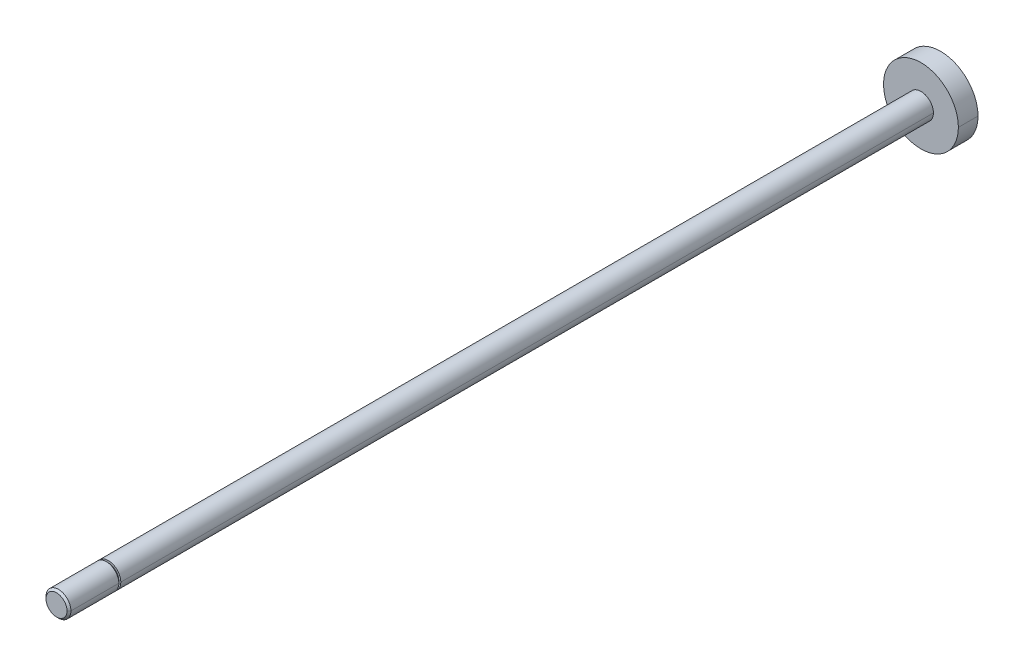
ISO-10303-21;
HEADER;
FILE_DESCRIPTION(('STEP AP214'),'2;1');
FILE_NAME('part.step','',(''),(''),'','','');
FILE_SCHEMA(('AUTOMOTIVE_DESIGN { 1 0 10303 214 1 1 1 1 }'));
ENDSEC;
DATA;
#1=APPLICATION_CONTEXT('core data for automotive mechanical design processes');
#2=APPLICATION_PROTOCOL_DEFINITION('international standard','automotive_design',2000,#1);
#3=PRODUCT_CONTEXT('',#1,'mechanical');
#4=PRODUCT('Part','Part','',(#3));
#5=PRODUCT_RELATED_PRODUCT_CATEGORY('part','',(#4));
#6=PRODUCT_DEFINITION_FORMATION('','',#4);
#7=PRODUCT_DEFINITION_CONTEXT('part definition',#1,'design');
#8=PRODUCT_DEFINITION('design','',#6,#7);
#9=PRODUCT_DEFINITION_SHAPE('','',#8);
#10=(LENGTH_UNIT() NAMED_UNIT(*) SI_UNIT(.MILLI.,.METRE.));
#11=(NAMED_UNIT(*) PLANE_ANGLE_UNIT() SI_UNIT($,.RADIAN.));
#12=(NAMED_UNIT(*) SI_UNIT($,.STERADIAN.) SOLID_ANGLE_UNIT());
#13=UNCERTAINTY_MEASURE_WITH_UNIT(LENGTH_MEASURE(1.E-05),#10,'distance_accuracy_value','');
#14=(GEOMETRIC_REPRESENTATION_CONTEXT(3) GLOBAL_UNCERTAINTY_ASSIGNED_CONTEXT((#13)) GLOBAL_UNIT_ASSIGNED_CONTEXT((#10,
#11,#12)) REPRESENTATION_CONTEXT('',''));
#15=CARTESIAN_POINT('',(0.,0.,0.));
#16=DIRECTION('',(0.,0.,1.));
#17=DIRECTION('',(1.,0.,0.));
#18=AXIS2_PLACEMENT_3D('',#15,#16,#17);
#19=CARTESIAN_POINT('',(0.,0.,146.431));
#20=DIRECTION('',(0.,0.,-1.));
#21=DIRECTION('',(0.,1.,0.));
#22=AXIS2_PLACEMENT_3D('',#19,#20,#21);
#23=PLANE('',#22);
#24=CARTESIAN_POINT('',(0.,0.,146.431));
#25=DIRECTION('',(0.,0.,-1.));
#26=DIRECTION('',(1.,0.,0.));
#27=AXIS2_PLACEMENT_3D('',#24,#25,#26);
#28=CIRCLE('',#27,2.67499999999996);
#29=CARTESIAN_POINT('',(2.67499999999996,0.,146.431));
#30=VERTEX_POINT('',#29);
#31=CARTESIAN_POINT('',(-2.67499999999996,0.,146.431));
#32=VERTEX_POINT('',#31);
#33=EDGE_CURVE('E135',#30,#32,#28,.T.);
#34=ORIENTED_EDGE('',*,*,#33,.F.);
#35=CARTESIAN_POINT('',(0.,0.,146.431));
#36=DIRECTION('',(0.,0.,-1.));
#37=DIRECTION('',(1.,0.,0.));
#38=AXIS2_PLACEMENT_3D('',#35,#36,#37);
#39=CIRCLE('',#38,2.67499999999996);
#40=EDGE_CURVE('E10',#32,#30,#39,.T.);
#41=ORIENTED_EDGE('',*,*,#40,.F.);
#42=EDGE_LOOP('',(#34,#41));
#43=FACE_BOUND('',#42,.T.);
#44=ADVANCED_FACE('F16',(#43),#23,.F.);
#45=CARTESIAN_POINT('',(0.,0.,146.431));
#46=DIRECTION('',(0.,0.,-1.));
#47=DIRECTION('',(1.,0.,0.));
#48=AXIS2_PLACEMENT_3D('',#45,#46,#47);
#49=CONICAL_SURFACE('',#48,2.67499999999996,0.785398163397452);
#50=DIRECTION('',(-0.70710678118655,0.,-0.707106781186545));
#51=VECTOR('',#50,1.);
#52=CARTESIAN_POINT('',(-2.67499999999996,0.,146.431));
#53=LINE('',#52,#51);
#54=CARTESIAN_POINT('',(-3.17499999999996,0.,145.931));
#55=VERTEX_POINT('',#54);
#56=EDGE_CURVE('E129',#32,#55,#53,.T.);
#57=ORIENTED_EDGE('',*,*,#56,.F.);
#58=ORIENTED_EDGE('',*,*,#40,.T.);
#59=DIRECTION('',(0.70710678118655,0.,-0.707106781186545));
#60=VECTOR('',#59,1.);
#61=CARTESIAN_POINT('',(2.67499999999996,0.,146.431));
#62=LINE('',#61,#60);
#63=CARTESIAN_POINT('',(3.17499999999996,0.,145.931));
#64=VERTEX_POINT('',#63);
#65=EDGE_CURVE('E126',#30,#64,#62,.T.);
#66=ORIENTED_EDGE('',*,*,#65,.T.);
#67=CARTESIAN_POINT('',(0.,0.,145.931));
#68=DIRECTION('',(0.,0.,-1.));
#69=DIRECTION('',(1.,0.,0.));
#70=AXIS2_PLACEMENT_3D('',#67,#68,#69);
#71=CIRCLE('',#70,3.17499999999996);
#72=EDGE_CURVE('E26',#55,#64,#71,.T.);
#73=ORIENTED_EDGE('',*,*,#72,.F.);
#74=EDGE_LOOP('',(#57,#58,#66,#73));
#75=FACE_BOUND('',#74,.T.);
#76=ADVANCED_FACE('F125',(#75),#49,.T.);
#77=CARTESIAN_POINT('',(0.,0.,155.411256121069));
#78=DIRECTION('',(0.,0.,-1.));
#79=DIRECTION('',(1.,0.,0.));
#80=AXIS2_PLACEMENT_3D('',#77,#78,#79);
#81=CYLINDRICAL_SURFACE('',#80,3.175);
#82=DIRECTION('',(0.,0.,-1.));
#83=VECTOR('',#82,1.);
#84=CARTESIAN_POINT('',(-3.175,0.,155.411256121069));
#85=LINE('',#84,#83);
#86=CARTESIAN_POINT('',(-3.17499999999996,0.,133.731));
#87=VERTEX_POINT('',#86);
#88=EDGE_CURVE('E139',#55,#87,#85,.T.);
#89=ORIENTED_EDGE('',*,*,#88,.F.);
#90=ORIENTED_EDGE('',*,*,#72,.T.);
#91=DIRECTION('',(0.,0.,-1.));
#92=VECTOR('',#91,1.);
#93=CARTESIAN_POINT('',(3.175,0.,155.411256121069));
#94=LINE('',#93,#92);
#95=CARTESIAN_POINT('',(3.17499999999996,0.,133.731));
#96=VERTEX_POINT('',#95);
#97=EDGE_CURVE('E182',#64,#96,#94,.T.);
#98=ORIENTED_EDGE('',*,*,#97,.T.);
#99=CARTESIAN_POINT('',(0.,0.,133.731));
#100=DIRECTION('',(0.,0.,-1.));
#101=DIRECTION('',(1.,0.,0.));
#102=AXIS2_PLACEMENT_3D('',#99,#100,#101);
#103=CIRCLE('',#102,3.17499999999996);
#104=EDGE_CURVE('E174',#87,#96,#103,.T.);
#105=ORIENTED_EDGE('',*,*,#104,.F.);
#106=EDGE_LOOP('',(#89,#90,#98,#105));
#107=FACE_BOUND('',#106,.T.);
#108=ADVANCED_FACE('F257',(#107),#81,.T.);
#109=CARTESIAN_POINT('',(0.,0.,-76.2));
#110=DIRECTION('',(0.,0.,-1.));
#111=DIRECTION('',(1.,0.,0.));
#112=AXIS2_PLACEMENT_3D('',#109,#110,#111);
#113=CYLINDRICAL_SURFACE('',#112,2.67499999999996);
#114=DIRECTION('',(0.,0.,-1.));
#115=VECTOR('',#114,1.);
#116=CARTESIAN_POINT('',(-2.67499999999996,0.,-76.2));
#117=LINE('',#116,#115);
#118=CARTESIAN_POINT('',(-2.67499999999996,0.,133.731));
#119=VERTEX_POINT('',#118);
#120=CARTESIAN_POINT('',(-2.67499999999996,0.,133.231));
#121=VERTEX_POINT('',#120);
#122=EDGE_CURVE('E151',#119,#121,#117,.T.);
#123=ORIENTED_EDGE('',*,*,#122,.F.);
#124=CARTESIAN_POINT('',(0.,0.,133.731));
#125=DIRECTION('',(0.,0.,-1.));
#126=DIRECTION('',(1.,0.,0.));
#127=AXIS2_PLACEMENT_3D('',#124,#125,#126);
#128=CIRCLE('',#127,2.67499999999996);
#129=CARTESIAN_POINT('',(2.67499999999996,0.,133.731));
#130=VERTEX_POINT('',#129);
#131=EDGE_CURVE('E108',#119,#130,#128,.T.);
#132=ORIENTED_EDGE('',*,*,#131,.T.);
#133=DIRECTION('',(0.,0.,-1.));
#134=VECTOR('',#133,1.);
#135=CARTESIAN_POINT('',(2.67499999999996,0.,-76.2));
#136=LINE('',#135,#134);
#137=CARTESIAN_POINT('',(2.67499999999996,0.,133.231));
#138=VERTEX_POINT('',#137);
#139=EDGE_CURVE('E161',#130,#138,#136,.T.);
#140=ORIENTED_EDGE('',*,*,#139,.T.);
#141=CARTESIAN_POINT('',(0.,0.,133.231));
#142=DIRECTION('',(0.,0.,-1.));
#143=DIRECTION('',(1.,0.,0.));
#144=AXIS2_PLACEMENT_3D('',#141,#142,#143);
#145=CIRCLE('',#144,2.67499999999996);
#146=EDGE_CURVE('E171',#121,#138,#145,.T.);
#147=ORIENTED_EDGE('',*,*,#146,.F.);
#148=EDGE_LOOP('',(#123,#132,#140,#147));
#149=FACE_BOUND('',#148,.T.);
#150=ADVANCED_FACE('F262',(#149),#113,.T.);
#151=CARTESIAN_POINT('',(0.,-3.17499999999996,133.731));
#152=DIRECTION('',(0.,0.,1.));
#153=DIRECTION('',(-1.,0.,0.));
#154=AXIS2_PLACEMENT_3D('',#151,#152,#153);
#155=PLANE('',#154);
#156=CARTESIAN_POINT('',(0.,0.,133.731));
#157=DIRECTION('',(0.,0.,-1.));
#158=DIRECTION('',(1.,0.,0.));
#159=AXIS2_PLACEMENT_3D('',#156,#157,#158);
#160=CIRCLE('',#159,2.67499999999996);
#161=EDGE_CURVE('E179',#130,#119,#160,.T.);
#162=ORIENTED_EDGE('',*,*,#161,.F.);
#163=ORIENTED_EDGE('',*,*,#131,.F.);
#164=EDGE_LOOP('',(#162,#163));
#165=FACE_BOUND('',#164,.T.);
#166=CARTESIAN_POINT('',(0.,0.,133.731));
#167=DIRECTION('',(0.,0.,-1.));
#168=DIRECTION('',(1.,0.,0.));
#169=AXIS2_PLACEMENT_3D('',#166,#167,#168);
#170=CIRCLE('',#169,3.17499999999996);
#171=EDGE_CURVE('E206',#96,#87,#170,.T.);
#172=ORIENTED_EDGE('',*,*,#171,.T.);
#173=ORIENTED_EDGE('',*,*,#104,.T.);
#174=EDGE_LOOP('',(#172,#173));
#175=FACE_BOUND('',#174,.T.);
#176=ADVANCED_FACE('F264',(#165,#175),#155,.F.);
#177=CARTESIAN_POINT('',(0.,-2.67499999999996,133.231));
#178=DIRECTION('',(0.,0.,-1.));
#179=DIRECTION('',(0.,1.,0.));
#180=AXIS2_PLACEMENT_3D('',#177,#178,#179);
#181=PLANE('',#180);
#182=CARTESIAN_POINT('',(0.,0.,133.231));
#183=DIRECTION('',(0.,0.,-1.));
#184=DIRECTION('',(1.,0.,0.));
#185=AXIS2_PLACEMENT_3D('',#182,#183,#184);
#186=CIRCLE('',#185,2.67499999999996);
#187=EDGE_CURVE('E20',#138,#121,#186,.T.);
#188=ORIENTED_EDGE('',*,*,#187,.T.);
#189=ORIENTED_EDGE('',*,*,#146,.T.);
#190=EDGE_LOOP('',(#188,#189));
#191=FACE_BOUND('',#190,.T.);
#192=CARTESIAN_POINT('',(0.,0.,133.231));
#193=DIRECTION('',(0.,0.,-1.));
#194=DIRECTION('',(1.,0.,0.));
#195=AXIS2_PLACEMENT_3D('',#192,#193,#194);
#196=CIRCLE('',#195,3.175);
#197=CARTESIAN_POINT('',(3.175,0.,133.231));
#198=VERTEX_POINT('',#197);
#199=CARTESIAN_POINT('',(-3.175,0.,133.231));
#200=VERTEX_POINT('',#199);
#201=EDGE_CURVE('E156',#198,#200,#196,.T.);
#202=ORIENTED_EDGE('',*,*,#201,.F.);
#203=CARTESIAN_POINT('',(0.,0.,133.231));
#204=DIRECTION('',(0.,0.,-1.));
#205=DIRECTION('',(1.,0.,0.));
#206=AXIS2_PLACEMENT_3D('',#203,#204,#205);
#207=CIRCLE('',#206,3.175);
#208=EDGE_CURVE('E153',#200,#198,#207,.T.);
#209=ORIENTED_EDGE('',*,*,#208,.F.);
#210=EDGE_LOOP('',(#202,#209));
#211=FACE_BOUND('',#210,.T.);
#212=ADVANCED_FACE('F18',(#191,#211),#181,.F.);
#213=CARTESIAN_POINT('',(0.,0.,155.411256121069));
#214=DIRECTION('',(0.,0.,-1.));
#215=DIRECTION('',(1.,0.,0.));
#216=AXIS2_PLACEMENT_3D('',#213,#214,#215);
#217=CYLINDRICAL_SURFACE('',#216,3.175);
#218=DIRECTION('',(0.,0.,-1.));
#219=VECTOR('',#218,1.);
#220=CARTESIAN_POINT('',(-3.175,0.,155.411256121069));
#221=LINE('',#220,#219);
#222=CARTESIAN_POINT('',(-3.175,0.,-73.7));
#223=VERTEX_POINT('',#222);
#224=EDGE_CURVE('E160',#200,#223,#221,.T.);
#225=ORIENTED_EDGE('',*,*,#224,.F.);
#226=ORIENTED_EDGE('',*,*,#208,.T.);
#227=DIRECTION('',(0.,0.,-1.));
#228=VECTOR('',#227,1.);
#229=CARTESIAN_POINT('',(3.175,0.,155.411256121069));
#230=LINE('',#229,#228);
#231=CARTESIAN_POINT('',(3.175,0.,-73.7));
#232=VERTEX_POINT('',#231);
#233=EDGE_CURVE('E166',#198,#232,#230,.T.);
#234=ORIENTED_EDGE('',*,*,#233,.T.);
#235=CARTESIAN_POINT('',(0.,0.,-73.7));
#236=DIRECTION('',(0.,0.,1.));
#237=DIRECTION('',(-1.,0.,0.));
#238=AXIS2_PLACEMENT_3D('',#235,#236,#237);
#239=CIRCLE('',#238,3.175);
#240=EDGE_CURVE('E154',#232,#223,#239,.T.);
#241=ORIENTED_EDGE('',*,*,#240,.T.);
#242=EDGE_LOOP('',(#225,#226,#234,#241));
#243=FACE_BOUND('',#242,.T.);
#244=ADVANCED_FACE('F292',(#243),#217,.T.);
#245=CARTESIAN_POINT('',(0.,0.,-78.7));
#246=DIRECTION('',(0.,0.,1.));
#247=DIRECTION('',(-1.,0.,0.));
#248=AXIS2_PLACEMENT_3D('',#245,#246,#247);
#249=PLANE('',#248);
#250=CARTESIAN_POINT('',(0.,0.,-78.7));
#251=DIRECTION('',(0.,0.,1.));
#252=DIRECTION('',(-1.,0.,0.));
#253=AXIS2_PLACEMENT_3D('',#250,#251,#252);
#254=CIRCLE('',#253,9.525);
#255=CARTESIAN_POINT('',(9.525,0.,-78.7));
#256=VERTEX_POINT('',#255);
#257=CARTESIAN_POINT('',(-9.525,0.,-78.7));
#258=VERTEX_POINT('',#257);
#259=EDGE_CURVE('E39',#256,#258,#254,.T.);
#260=ORIENTED_EDGE('',*,*,#259,.F.);
#261=CARTESIAN_POINT('',(0.,0.,-78.7));
#262=DIRECTION('',(0.,0.,1.));
#263=DIRECTION('',(-1.,0.,0.));
#264=AXIS2_PLACEMENT_3D('',#261,#262,#263);
#265=CIRCLE('',#264,9.525);
#266=EDGE_CURVE('E200',#258,#256,#265,.T.);
#267=ORIENTED_EDGE('',*,*,#266,.F.);
#268=EDGE_LOOP('',(#260,#267));
#269=FACE_BOUND('',#268,.T.);
#270=ADVANCED_FACE('F249',(#269),#249,.F.);
#271=CARTESIAN_POINT('',(0.,0.,-73.7));
#272=DIRECTION('',(0.,0.,-1.));
#273=DIRECTION('',(1.,0.,0.));
#274=AXIS2_PLACEMENT_3D('',#271,#272,#273);
#275=CYLINDRICAL_SURFACE('',#274,9.525);
#276=DIRECTION('',(0.,0.,-1.));
#277=VECTOR('',#276,1.);
#278=CARTESIAN_POINT('',(-9.525,0.,-73.7));
#279=LINE('',#278,#277);
#280=CARTESIAN_POINT('',(-9.525,0.,-73.7));
#281=VERTEX_POINT('',#280);
#282=EDGE_CURVE('E213',#281,#258,#279,.T.);
#283=ORIENTED_EDGE('',*,*,#282,.F.);
#284=CARTESIAN_POINT('',(0.,0.,-73.7));
#285=DIRECTION('',(0.,0.,1.));
#286=DIRECTION('',(-1.,0.,0.));
#287=AXIS2_PLACEMENT_3D('',#284,#285,#286);
#288=CIRCLE('',#287,9.525);
#289=CARTESIAN_POINT('',(9.525,0.,-73.7));
#290=VERTEX_POINT('',#289);
#291=EDGE_CURVE('E185',#290,#281,#288,.T.);
#292=ORIENTED_EDGE('',*,*,#291,.F.);
#293=DIRECTION('',(0.,0.,-1.));
#294=VECTOR('',#293,1.);
#295=CARTESIAN_POINT('',(9.525,0.,-73.7));
#296=LINE('',#295,#294);
#297=EDGE_CURVE('E193',#290,#256,#296,.T.);
#298=ORIENTED_EDGE('',*,*,#297,.T.);
#299=ORIENTED_EDGE('',*,*,#259,.T.);
#300=EDGE_LOOP('',(#283,#292,#298,#299));
#301=FACE_BOUND('',#300,.T.);
#302=ADVANCED_FACE('F237',(#301),#275,.T.);
#303=CARTESIAN_POINT('',(0.,0.,-73.7));
#304=DIRECTION('',(0.,0.,1.));
#305=DIRECTION('',(-1.,0.,0.));
#306=AXIS2_PLACEMENT_3D('',#303,#304,#305);
#307=PLANE('',#306);
#308=ORIENTED_EDGE('',*,*,#240,.F.);
#309=CARTESIAN_POINT('',(0.,0.,-73.7));
#310=DIRECTION('',(0.,0.,1.));
#311=DIRECTION('',(-1.,0.,0.));
#312=AXIS2_PLACEMENT_3D('',#309,#310,#311);
#313=CIRCLE('',#312,3.175);
#314=EDGE_CURVE('E165',#223,#232,#313,.T.);
#315=ORIENTED_EDGE('',*,*,#314,.F.);
#316=EDGE_LOOP('',(#308,#315));
#317=FACE_BOUND('',#316,.T.);
#318=ORIENTED_EDGE('',*,*,#291,.T.);
#319=CARTESIAN_POINT('',(0.,0.,-73.7));
#320=DIRECTION('',(0.,0.,1.));
#321=DIRECTION('',(-1.,0.,0.));
#322=AXIS2_PLACEMENT_3D('',#319,#320,#321);
#323=CIRCLE('',#322,9.525);
#324=EDGE_CURVE('E170',#281,#290,#323,.T.);
#325=ORIENTED_EDGE('',*,*,#324,.T.);
#326=EDGE_LOOP('',(#318,#325));
#327=FACE_BOUND('',#326,.T.);
#328=ADVANCED_FACE('F238',(#317,#327),#307,.T.);
#329=CARTESIAN_POINT('',(0.,0.,-73.7));
#330=DIRECTION('',(0.,0.,-1.));
#331=DIRECTION('',(1.,0.,0.));
#332=AXIS2_PLACEMENT_3D('',#329,#330,#331);
#333=CYLINDRICAL_SURFACE('',#332,9.525);
#334=ORIENTED_EDGE('',*,*,#324,.F.);
#335=ORIENTED_EDGE('',*,*,#282,.T.);
#336=ORIENTED_EDGE('',*,*,#266,.T.);
#337=ORIENTED_EDGE('',*,*,#297,.F.);
#338=EDGE_LOOP('',(#334,#335,#336,#337));
#339=FACE_BOUND('',#338,.T.);
#340=ADVANCED_FACE('F235',(#339),#333,.T.);
#341=CARTESIAN_POINT('',(0.,0.,155.411256121069));
#342=DIRECTION('',(0.,0.,-1.));
#343=DIRECTION('',(1.,0.,0.));
#344=AXIS2_PLACEMENT_3D('',#341,#342,#343);
#345=CYLINDRICAL_SURFACE('',#344,3.175);
#346=ORIENTED_EDGE('',*,*,#201,.T.);
#347=ORIENTED_EDGE('',*,*,#224,.T.);
#348=ORIENTED_EDGE('',*,*,#314,.T.);
#349=ORIENTED_EDGE('',*,*,#233,.F.);
#350=EDGE_LOOP('',(#346,#347,#348,#349));
#351=FACE_BOUND('',#350,.T.);
#352=ADVANCED_FACE('F247',(#351),#345,.T.);
#353=CARTESIAN_POINT('',(0.,0.,-76.2));
#354=DIRECTION('',(0.,0.,-1.));
#355=DIRECTION('',(1.,0.,0.));
#356=AXIS2_PLACEMENT_3D('',#353,#354,#355);
#357=CYLINDRICAL_SURFACE('',#356,2.67499999999996);
#358=ORIENTED_EDGE('',*,*,#161,.T.);
#359=ORIENTED_EDGE('',*,*,#122,.T.);
#360=ORIENTED_EDGE('',*,*,#187,.F.);
#361=ORIENTED_EDGE('',*,*,#139,.F.);
#362=EDGE_LOOP('',(#358,#359,#360,#361));
#363=FACE_BOUND('',#362,.T.);
#364=ADVANCED_FACE('F277',(#363),#357,.T.);
#365=CARTESIAN_POINT('',(0.,0.,155.411256121069));
#366=DIRECTION('',(0.,0.,-1.));
#367=DIRECTION('',(1.,0.,0.));
#368=AXIS2_PLACEMENT_3D('',#365,#366,#367);
#369=CYLINDRICAL_SURFACE('',#368,3.175);
#370=CARTESIAN_POINT('',(0.,0.,145.931));
#371=DIRECTION('',(0.,0.,-1.));
#372=DIRECTION('',(1.,0.,0.));
#373=AXIS2_PLACEMENT_3D('',#370,#371,#372);
#374=CIRCLE('',#373,3.17499999999996);
#375=EDGE_CURVE('E137',#64,#55,#374,.T.);
#376=ORIENTED_EDGE('',*,*,#375,.T.);
#377=ORIENTED_EDGE('',*,*,#88,.T.);
#378=ORIENTED_EDGE('',*,*,#171,.F.);
#379=ORIENTED_EDGE('',*,*,#97,.F.);
#380=EDGE_LOOP('',(#376,#377,#378,#379));
#381=FACE_BOUND('',#380,.T.);
#382=ADVANCED_FACE('F269',(#381),#369,.T.);
#383=CARTESIAN_POINT('',(0.,0.,146.431));
#384=DIRECTION('',(0.,0.,-1.));
#385=DIRECTION('',(1.,0.,0.));
#386=AXIS2_PLACEMENT_3D('',#383,#384,#385);
#387=CONICAL_SURFACE('',#386,2.67499999999996,0.785398163397452);
#388=ORIENTED_EDGE('',*,*,#33,.T.);
#389=ORIENTED_EDGE('',*,*,#56,.T.);
#390=ORIENTED_EDGE('',*,*,#375,.F.);
#391=ORIENTED_EDGE('',*,*,#65,.F.);
#392=EDGE_LOOP('',(#388,#389,#390,#391));
#393=FACE_BOUND('',#392,.T.);
#394=ADVANCED_FACE('F134',(#393),#387,.T.);
#395=CLOSED_SHELL('',(#44,#76,#108,#150,#176,#212,#244,#270,#302,#328,#340,#352,#364,#382,#394));
#396=MANIFOLD_SOLID_BREP('B1',#395);
#397=ADVANCED_BREP_SHAPE_REPRESENTATION('',(#18,#396),#14);
#398=SHAPE_DEFINITION_REPRESENTATION(#9,#397);
ENDSEC;
END-ISO-10303-21;
